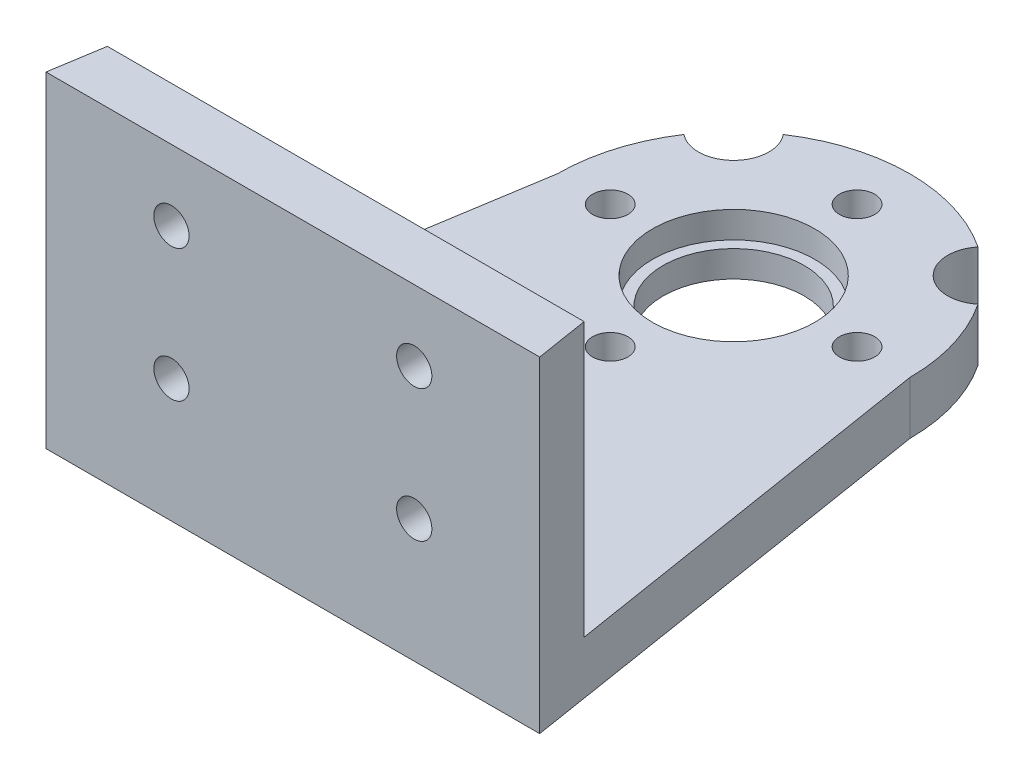
ISO-10303-21;
HEADER;
FILE_DESCRIPTION(('STEP AP214'),'2;1');
FILE_NAME('part.step','',(''),(''),'','','');
FILE_SCHEMA(('AUTOMOTIVE_DESIGN { 1 0 10303 214 1 1 1 1 }'));
ENDSEC;
DATA;
#1=APPLICATION_CONTEXT('core data for automotive mechanical design processes');
#2=APPLICATION_PROTOCOL_DEFINITION('international standard','automotive_design',2000,#1);
#3=PRODUCT_CONTEXT('',#1,'mechanical');
#4=PRODUCT('Part','Part','',(#3));
#5=PRODUCT_RELATED_PRODUCT_CATEGORY('part','',(#4));
#6=PRODUCT_DEFINITION_FORMATION('','',#4);
#7=PRODUCT_DEFINITION_CONTEXT('part definition',#1,'design');
#8=PRODUCT_DEFINITION('design','',#6,#7);
#9=PRODUCT_DEFINITION_SHAPE('','',#8);
#10=(LENGTH_UNIT() NAMED_UNIT(*) SI_UNIT(.MILLI.,.METRE.));
#11=(NAMED_UNIT(*) PLANE_ANGLE_UNIT() SI_UNIT($,.RADIAN.));
#12=(NAMED_UNIT(*) SI_UNIT($,.STERADIAN.) SOLID_ANGLE_UNIT());
#13=UNCERTAINTY_MEASURE_WITH_UNIT(LENGTH_MEASURE(1.E-05),#10,'distance_accuracy_value','');
#14=(GEOMETRIC_REPRESENTATION_CONTEXT(3) GLOBAL_UNCERTAINTY_ASSIGNED_CONTEXT((#13)) GLOBAL_UNIT_ASSIGNED_CONTEXT((#10,
#11,#12)) REPRESENTATION_CONTEXT('',''));
#15=CARTESIAN_POINT('',(0.,0.,0.));
#16=DIRECTION('',(0.,0.,1.));
#17=DIRECTION('',(1.,0.,0.));
#18=AXIS2_PLACEMENT_3D('',#15,#16,#17);
#19=CARTESIAN_POINT('',(0.,3.,0.));
#20=DIRECTION('',(0.,-1.,0.));
#21=DIRECTION('',(0.,0.,-1.));
#22=AXIS2_PLACEMENT_3D('',#19,#20,#21);
#23=CYLINDRICAL_SURFACE('',#22,10.);
#24=CARTESIAN_POINT('',(0.,0.,0.));
#25=DIRECTION('',(0.,1.,0.));
#26=DIRECTION('',(0.,0.,-1.));
#27=AXIS2_PLACEMENT_3D('',#24,#25,#26);
#28=CIRCLE('',#27,10.);
#29=CARTESIAN_POINT('',(10.,0.,0.));
#30=VERTEX_POINT('',#29);
#31=CARTESIAN_POINT('',(8.33677118357518,0.,-5.52252172768116));
#32=VERTEX_POINT('',#31);
#33=EDGE_CURVE('E220',#30,#32,#28,.T.);
#34=ORIENTED_EDGE('',*,*,#33,.T.);
#35=DIRECTION('',(0.,1.,0.));
#36=VECTOR('',#35,1.);
#37=CARTESIAN_POINT('',(8.33677118357519,-2.,-5.52252172768115));
#38=LINE('',#37,#36);
#39=CARTESIAN_POINT('',(8.33677118357519,3.,-5.52252172768115));
#40=VERTEX_POINT('',#39);
#41=EDGE_CURVE('E50',#32,#40,#38,.T.);
#42=ORIENTED_EDGE('',*,*,#41,.T.);
#43=CARTESIAN_POINT('',(0.,3.,0.));
#44=DIRECTION('',(0.,1.,0.));
#45=DIRECTION('',(0.,0.,-1.));
#46=AXIS2_PLACEMENT_3D('',#43,#44,#45);
#47=CIRCLE('',#46,10.);
#48=CARTESIAN_POINT('',(10.,3.,0.));
#49=VERTEX_POINT('',#48);
#50=EDGE_CURVE('E124',#49,#40,#47,.T.);
#51=ORIENTED_EDGE('',*,*,#50,.F.);
#52=DIRECTION('',(0.,-1.,0.));
#53=VECTOR('',#52,1.);
#54=CARTESIAN_POINT('',(10.,3.,0.));
#55=LINE('',#54,#53);
#56=EDGE_CURVE('E148',#49,#30,#55,.T.);
#57=ORIENTED_EDGE('',*,*,#56,.T.);
#58=EDGE_LOOP('',(#34,#42,#51,#57));
#59=FACE_BOUND('',#58,.T.);
#60=ADVANCED_FACE('F36',(#59),#23,.T.);
#61=CARTESIAN_POINT('',(5.52252172768112,3.,-8.33677118357521));
#62=VERTEX_POINT('',#61);
#63=CARTESIAN_POINT('',(-5.52252172768112,3.,-8.33677118357521));
#64=VERTEX_POINT('',#63);
#65=EDGE_CURVE('E121',#62,#64,#47,.T.);
#66=ORIENTED_EDGE('',*,*,#65,.F.);
#67=DIRECTION('',(0.,1.,0.));
#68=VECTOR('',#67,1.);
#69=CARTESIAN_POINT('',(5.52252172768112,-2.,-8.33677118357521));
#70=LINE('',#69,#68);
#71=CARTESIAN_POINT('',(5.52252172768113,0.,-8.3367711835752));
#72=VERTEX_POINT('',#71);
#73=EDGE_CURVE('E111',#62,#72,#70,.F.);
#74=ORIENTED_EDGE('',*,*,#73,.T.);
#75=CARTESIAN_POINT('',(-5.52252172768113,0.,-8.3367711835752));
#76=VERTEX_POINT('',#75);
#77=EDGE_CURVE('E58',#72,#76,#28,.T.);
#78=ORIENTED_EDGE('',*,*,#77,.T.);
#79=DIRECTION('',(0.,1.,0.));
#80=VECTOR('',#79,1.);
#81=CARTESIAN_POINT('',(-5.52252172768112,-2.,-8.33677118357521));
#82=LINE('',#81,#80);
#83=EDGE_CURVE('E128',#76,#64,#82,.T.);
#84=ORIENTED_EDGE('',*,*,#83,.T.);
#85=EDGE_LOOP('',(#66,#74,#78,#84));
#86=FACE_BOUND('',#85,.T.);
#87=ADVANCED_FACE('F127',(#86),#23,.T.);
#88=CARTESIAN_POINT('',(0.,-10.,0.));
#89=DIRECTION('',(0.,1.,0.));
#90=DIRECTION('',(0.,0.,1.));
#91=AXIS2_PLACEMENT_3D('',#88,#89,#90);
#92=CYLINDRICAL_SURFACE('',#91,4.);
#93=CARTESIAN_POINT('',(0.,0.,0.));
#94=DIRECTION('',(0.,-1.,0.));
#95=DIRECTION('',(0.,0.,-1.));
#96=AXIS2_PLACEMENT_3D('',#93,#94,#95);
#97=CIRCLE('',#96,4.);
#98=CARTESIAN_POINT('',(0.,0.,-4.));
#99=VERTEX_POINT('',#98);
#100=EDGE_CURVE('E216',#99,#99,#97,.T.);
#101=ORIENTED_EDGE('',*,*,#100,.T.);
#102=EDGE_LOOP('',(#101));
#103=FACE_BOUND('',#102,.T.);
#104=CARTESIAN_POINT('',(0.,1.5,0.));
#105=DIRECTION('',(0.,1.,0.));
#106=DIRECTION('',(0.,0.,1.));
#107=AXIS2_PLACEMENT_3D('',#104,#105,#106);
#108=CIRCLE('',#107,4.);
#109=CARTESIAN_POINT('',(0.,1.5,4.));
#110=VERTEX_POINT('',#109);
#111=EDGE_CURVE('E154',#110,#110,#108,.F.);
#112=ORIENTED_EDGE('',*,*,#111,.F.);
#113=EDGE_LOOP('',(#112));
#114=FACE_BOUND('',#113,.T.);
#115=ADVANCED_FACE('F351',(#103,#114),#92,.F.);
#116=CARTESIAN_POINT('',(0.,3.,0.));
#117=DIRECTION('',(0.,-1.,0.));
#118=DIRECTION('',(0.,0.,-1.));
#119=AXIS2_PLACEMENT_3D('',#116,#117,#118);
#120=PLANE('',#119);
#121=CARTESIAN_POINT('',(0.,3.,0.));
#122=DIRECTION('',(0.,1.,0.));
#123=DIRECTION('',(0.,0.,1.));
#124=AXIS2_PLACEMENT_3D('',#121,#122,#123);
#125=CIRCLE('',#124,4.6);
#126=CARTESIAN_POINT('',(0.,3.,4.6));
#127=VERTEX_POINT('',#126);
#128=EDGE_CURVE('E275',#127,#127,#125,.T.);
#129=ORIENTED_EDGE('',*,*,#128,.F.);
#130=EDGE_LOOP('',(#129));
#131=FACE_BOUND('',#130,.T.);
#132=CARTESIAN_POINT('',(-6.52,3.,19.));
#133=DIRECTION('',(0.,1.,0.));
#134=DIRECTION('',(0.,0.,1.));
#135=AXIS2_PLACEMENT_3D('',#132,#133,#134);
#136=CIRCLE('',#135,1.);
#137=CARTESIAN_POINT('',(-6.52,3.,20.));
#138=VERTEX_POINT('',#137);
#139=EDGE_CURVE('E135',#138,#138,#136,.T.);
#140=ORIENTED_EDGE('',*,*,#139,.F.);
#141=EDGE_LOOP('',(#140));
#142=FACE_BOUND('',#141,.T.);
#143=CARTESIAN_POINT('',(6.52,3.,19.));
#144=DIRECTION('',(0.,1.,0.));
#145=DIRECTION('',(0.,0.,-1.));
#146=AXIS2_PLACEMENT_3D('',#143,#144,#145);
#147=CIRCLE('',#146,1.);
#148=CARTESIAN_POINT('',(6.52,3.,18.));
#149=VERTEX_POINT('',#148);
#150=EDGE_CURVE('E189',#149,#149,#147,.T.);
#151=ORIENTED_EDGE('',*,*,#150,.F.);
#152=EDGE_LOOP('',(#151));
#153=FACE_BOUND('',#152,.T.);
#154=CARTESIAN_POINT('',(0.,3.,19.));
#155=DIRECTION('',(0.,1.,0.));
#156=DIRECTION('',(0.,0.,1.));
#157=AXIS2_PLACEMENT_3D('',#154,#155,#156);
#158=CIRCLE('',#157,1.);
#159=CARTESIAN_POINT('',(0.,3.,20.));
#160=VERTEX_POINT('',#159);
#161=EDGE_CURVE('E185',#160,#160,#158,.T.);
#162=ORIENTED_EDGE('',*,*,#161,.F.);
#163=EDGE_LOOP('',(#162));
#164=FACE_BOUND('',#163,.T.);
#165=CARTESIAN_POINT('',(0.,3.,7.));
#166=DIRECTION('',(0.,1.,0.));
#167=DIRECTION('',(0.,0.,1.));
#168=AXIS2_PLACEMENT_3D('',#165,#166,#167);
#169=CIRCLE('',#168,1.);
#170=CARTESIAN_POINT('',(0.,3.,8.));
#171=VERTEX_POINT('',#170);
#172=EDGE_CURVE('E179',#171,#171,#169,.T.);
#173=ORIENTED_EDGE('',*,*,#172,.F.);
#174=EDGE_LOOP('',(#173));
#175=FACE_BOUND('',#174,.T.);
#176=CARTESIAN_POINT('',(-7.,3.,0.));
#177=DIRECTION('',(0.,1.,0.));
#178=DIRECTION('',(0.,0.,1.));
#179=AXIS2_PLACEMENT_3D('',#176,#177,#178);
#180=CIRCLE('',#179,1.);
#181=CARTESIAN_POINT('',(-7.,3.,0.999999999999975));
#182=VERTEX_POINT('',#181);
#183=EDGE_CURVE('E173',#182,#182,#180,.T.);
#184=ORIENTED_EDGE('',*,*,#183,.F.);
#185=EDGE_LOOP('',(#184));
#186=FACE_BOUND('',#185,.T.);
#187=CARTESIAN_POINT('',(0.,3.,-7.));
#188=DIRECTION('',(0.,1.,0.));
#189=DIRECTION('',(0.,0.,1.));
#190=AXIS2_PLACEMENT_3D('',#187,#188,#189);
#191=CIRCLE('',#190,1.);
#192=CARTESIAN_POINT('',(0.,3.,-6.));
#193=VERTEX_POINT('',#192);
#194=EDGE_CURVE('E165',#193,#193,#191,.T.);
#195=ORIENTED_EDGE('',*,*,#194,.F.);
#196=EDGE_LOOP('',(#195));
#197=FACE_BOUND('',#196,.T.);
#198=CARTESIAN_POINT('',(7.,3.,0.));
#199=DIRECTION('',(0.,1.,0.));
#200=DIRECTION('',(0.,0.,1.));
#201=AXIS2_PLACEMENT_3D('',#198,#199,#200);
#202=CIRCLE('',#201,1.);
#203=CARTESIAN_POINT('',(7.,3.,1.00000000000007));
#204=VERTEX_POINT('',#203);
#205=EDGE_CURVE('E166',#204,#204,#202,.T.);
#206=ORIENTED_EDGE('',*,*,#205,.F.);
#207=EDGE_LOOP('',(#206));
#208=FACE_BOUND('',#207,.T.);
#209=ORIENTED_EDGE('',*,*,#50,.T.);
#210=CARTESIAN_POINT('',(7.07106781186546,3.,-7.07106781186549));
#211=DIRECTION('',(0.,1.,0.));
#212=DIRECTION('',(0.,0.,-1.));
#213=AXIS2_PLACEMENT_3D('',#210,#211,#212);
#214=CIRCLE('',#213,2.);
#215=EDGE_CURVE('E114',#62,#40,#214,.T.);
#216=ORIENTED_EDGE('',*,*,#215,.F.);
#217=ORIENTED_EDGE('',*,*,#65,.T.);
#218=CARTESIAN_POINT('',(-7.07106781186546,3.,-7.07106781186549));
#219=DIRECTION('',(0.,1.,0.));
#220=DIRECTION('',(0.,0.,1.));
#221=AXIS2_PLACEMENT_3D('',#218,#219,#220);
#222=CIRCLE('',#221,2.);
#223=CARTESIAN_POINT('',(-8.33677118357519,3.,-5.52252172768115));
#224=VERTEX_POINT('',#223);
#225=EDGE_CURVE('E283',#224,#64,#222,.T.);
#226=ORIENTED_EDGE('',*,*,#225,.F.);
#227=CARTESIAN_POINT('',(-10.,3.,0.));
#228=VERTEX_POINT('',#227);
#229=EDGE_CURVE('E129',#224,#228,#47,.T.);
#230=ORIENTED_EDGE('',*,*,#229,.T.);
#231=DIRECTION('',(-0.157990501106673,0.,0.987440631916705));
#232=VECTOR('',#231,1.);
#233=CARTESIAN_POINT('',(-10.,3.,0.));
#234=LINE('',#233,#232);
#235=CARTESIAN_POINT('',(-13.52,3.,22.));
#236=VERTEX_POINT('',#235);
#237=EDGE_CURVE('E131',#228,#236,#234,.T.);
#238=ORIENTED_EDGE('',*,*,#237,.T.);
#239=DIRECTION('',(-1.,0.,0.));
#240=VECTOR('',#239,1.);
#241=CARTESIAN_POINT('',(-13.52,3.,22.));
#242=LINE('',#241,#240);
#243=CARTESIAN_POINT('',(13.52,3.,22.));
#244=VERTEX_POINT('',#243);
#245=EDGE_CURVE('E149',#244,#236,#242,.T.);
#246=ORIENTED_EDGE('',*,*,#245,.F.);
#247=DIRECTION('',(-0.157990501106673,0.,-0.987440631916705));
#248=VECTOR('',#247,1.);
#249=CARTESIAN_POINT('',(10.,3.,0.));
#250=LINE('',#249,#248);
#251=EDGE_CURVE('E144',#244,#49,#250,.T.);
#252=ORIENTED_EDGE('',*,*,#251,.T.);
#253=EDGE_LOOP('',(#209,#216,#217,#226,#230,#238,#246,#252));
#254=FACE_BOUND('',#253,.T.);
#255=ADVANCED_FACE('F119',(#131,#142,#153,#164,#175,#186,#197,#208,#254),#120,.F.);
#256=ORIENTED_EDGE('',*,*,#229,.F.);
#257=DIRECTION('',(0.,1.,0.));
#258=VECTOR('',#257,1.);
#259=CARTESIAN_POINT('',(-8.33677118357519,-2.,-5.52252172768115));
#260=LINE('',#259,#258);
#261=CARTESIAN_POINT('',(-8.33677118357518,0.,-5.52252172768116));
#262=VERTEX_POINT('',#261);
#263=EDGE_CURVE('E281',#224,#262,#260,.F.);
#264=ORIENTED_EDGE('',*,*,#263,.T.);
#265=CARTESIAN_POINT('',(-10.,0.,0.));
#266=VERTEX_POINT('',#265);
#267=EDGE_CURVE('E218',#262,#266,#28,.T.);
#268=ORIENTED_EDGE('',*,*,#267,.T.);
#269=DIRECTION('',(0.,-1.,0.));
#270=VECTOR('',#269,1.);
#271=CARTESIAN_POINT('',(-10.,3.,0.));
#272=LINE('',#271,#270);
#273=EDGE_CURVE('E223',#228,#266,#272,.T.);
#274=ORIENTED_EDGE('',*,*,#273,.F.);
#275=EDGE_LOOP('',(#256,#264,#268,#274));
#276=FACE_BOUND('',#275,.T.);
#277=ADVANCED_FACE('F38',(#276),#23,.T.);
#278=CARTESIAN_POINT('',(-10.,3.,0.));
#279=DIRECTION('',(0.987440631916705,0.,0.157990501106673));
#280=DIRECTION('',(0.157990501106673,0.,-0.987440631916705));
#281=AXIS2_PLACEMENT_3D('',#278,#279,#280);
#282=PLANE('',#281);
#283=DIRECTION('',(-0.157990501106673,0.,0.987440631916705));
#284=VECTOR('',#283,1.);
#285=CARTESIAN_POINT('',(-10.,0.,0.));
#286=LINE('',#285,#284);
#287=CARTESIAN_POINT('',(-14.,0.,25.));
#288=VERTEX_POINT('',#287);
#289=EDGE_CURVE('E237',#266,#288,#286,.T.);
#290=ORIENTED_EDGE('',*,*,#289,.T.);
#291=DIRECTION('',(0.,-1.,0.));
#292=VECTOR('',#291,1.);
#293=CARTESIAN_POINT('',(-14.,3.,25.));
#294=LINE('',#293,#292);
#295=CARTESIAN_POINT('',(-14.,18.5,25.));
#296=VERTEX_POINT('',#295);
#297=EDGE_CURVE('E226',#296,#288,#294,.T.);
#298=ORIENTED_EDGE('',*,*,#297,.F.);
#299=DIRECTION('',(-0.157990501106673,0.,0.987440631916705));
#300=VECTOR('',#299,1.);
#301=CARTESIAN_POINT('',(-13.52,18.5,22.));
#302=LINE('',#301,#300);
#303=CARTESIAN_POINT('',(-13.52,18.5,22.));
#304=VERTEX_POINT('',#303);
#305=EDGE_CURVE('E153',#304,#296,#302,.T.);
#306=ORIENTED_EDGE('',*,*,#305,.F.);
#307=DIRECTION('',(0.,-1.,0.));
#308=VECTOR('',#307,1.);
#309=CARTESIAN_POINT('',(-13.52,18.5,22.));
#310=LINE('',#309,#308);
#311=EDGE_CURVE('E155',#304,#236,#310,.T.);
#312=ORIENTED_EDGE('',*,*,#311,.T.);
#313=ORIENTED_EDGE('',*,*,#237,.F.);
#314=ORIENTED_EDGE('',*,*,#273,.T.);
#315=EDGE_LOOP('',(#290,#298,#306,#312,#313,#314));
#316=FACE_BOUND('',#315,.T.);
#317=ADVANCED_FACE('F329',(#316),#282,.F.);
#318=CARTESIAN_POINT('',(-14.,3.,25.));
#319=DIRECTION('',(0.,0.,-1.));
#320=DIRECTION('',(-1.,0.,0.));
#321=AXIS2_PLACEMENT_3D('',#318,#319,#320);
#322=PLANE('',#321);
#323=CARTESIAN_POINT('',(6.88499999999998,7.,25.));
#324=DIRECTION('',(0.,0.,-1.));
#325=DIRECTION('',(-1.,0.,0.));
#326=AXIS2_PLACEMENT_3D('',#323,#324,#325);
#327=CIRCLE('',#326,1.);
#328=CARTESIAN_POINT('',(5.88499999999998,7.,25.));
#329=VERTEX_POINT('',#328);
#330=EDGE_CURVE('E291',#329,#329,#327,.T.);
#331=ORIENTED_EDGE('',*,*,#330,.T.);
#332=EDGE_LOOP('',(#331));
#333=FACE_BOUND('',#332,.T.);
#334=CARTESIAN_POINT('',(-6.88499999999999,14.5,25.));
#335=DIRECTION('',(0.,0.,-1.));
#336=DIRECTION('',(-1.,0.,0.));
#337=AXIS2_PLACEMENT_3D('',#334,#335,#336);
#338=CIRCLE('',#337,1.);
#339=CARTESIAN_POINT('',(-7.885,14.5,25.));
#340=VERTEX_POINT('',#339);
#341=EDGE_CURVE('E294',#340,#340,#338,.T.);
#342=ORIENTED_EDGE('',*,*,#341,.T.);
#343=EDGE_LOOP('',(#342));
#344=FACE_BOUND('',#343,.T.);
#345=CARTESIAN_POINT('',(6.88500000000001,14.5,25.));
#346=DIRECTION('',(0.,0.,-1.));
#347=DIRECTION('',(-1.,0.,0.));
#348=AXIS2_PLACEMENT_3D('',#345,#346,#347);
#349=CIRCLE('',#348,1.);
#350=CARTESIAN_POINT('',(5.88500000000001,14.5,25.));
#351=VERTEX_POINT('',#350);
#352=EDGE_CURVE('E297',#351,#351,#349,.T.);
#353=ORIENTED_EDGE('',*,*,#352,.T.);
#354=EDGE_LOOP('',(#353));
#355=FACE_BOUND('',#354,.T.);
#356=CARTESIAN_POINT('',(-6.88500000000002,7.,25.));
#357=DIRECTION('',(0.,0.,-1.));
#358=DIRECTION('',(-1.,0.,0.));
#359=AXIS2_PLACEMENT_3D('',#356,#357,#358);
#360=CIRCLE('',#359,1.);
#361=CARTESIAN_POINT('',(-7.88500000000002,7.,25.));
#362=VERTEX_POINT('',#361);
#363=EDGE_CURVE('E125',#362,#362,#360,.T.);
#364=ORIENTED_EDGE('',*,*,#363,.T.);
#365=EDGE_LOOP('',(#364));
#366=FACE_BOUND('',#365,.T.);
#367=DIRECTION('',(1.,0.,0.));
#368=VECTOR('',#367,1.);
#369=CARTESIAN_POINT('',(-14.,0.,25.));
#370=LINE('',#369,#368);
#371=CARTESIAN_POINT('',(14.,0.,25.));
#372=VERTEX_POINT('',#371);
#373=EDGE_CURVE('E235',#288,#372,#370,.T.);
#374=ORIENTED_EDGE('',*,*,#373,.T.);
#375=DIRECTION('',(0.,-1.,0.));
#376=VECTOR('',#375,1.);
#377=CARTESIAN_POINT('',(14.,3.,25.));
#378=LINE('',#377,#376);
#379=CARTESIAN_POINT('',(14.,18.5,25.));
#380=VERTEX_POINT('',#379);
#381=EDGE_CURVE('E229',#380,#372,#378,.T.);
#382=ORIENTED_EDGE('',*,*,#381,.F.);
#383=DIRECTION('',(1.,0.,0.));
#384=VECTOR('',#383,1.);
#385=CARTESIAN_POINT('',(-14.,18.5,25.));
#386=LINE('',#385,#384);
#387=EDGE_CURVE('E269',#296,#380,#386,.T.);
#388=ORIENTED_EDGE('',*,*,#387,.F.);
#389=ORIENTED_EDGE('',*,*,#297,.T.);
#390=EDGE_LOOP('',(#374,#382,#388,#389));
#391=FACE_BOUND('',#390,.T.);
#392=ADVANCED_FACE('F328',(#333,#344,#355,#366,#391),#322,.F.);
#393=CARTESIAN_POINT('',(10.,3.,0.));
#394=DIRECTION('',(-0.987440631916705,0.,0.157990501106673));
#395=DIRECTION('',(0.157990501106673,0.,0.987440631916705));
#396=AXIS2_PLACEMENT_3D('',#393,#394,#395);
#397=PLANE('',#396);
#398=DIRECTION('',(-0.157990501106673,0.,-0.987440631916705));
#399=VECTOR('',#398,1.);
#400=CARTESIAN_POINT('',(10.,0.,0.));
#401=LINE('',#400,#399);
#402=EDGE_CURVE('E132',#372,#30,#401,.T.);
#403=ORIENTED_EDGE('',*,*,#402,.T.);
#404=ORIENTED_EDGE('',*,*,#56,.F.);
#405=ORIENTED_EDGE('',*,*,#251,.F.);
#406=DIRECTION('',(0.,-1.,0.));
#407=VECTOR('',#406,1.);
#408=CARTESIAN_POINT('',(13.52,18.5,22.));
#409=LINE('',#408,#407);
#410=CARTESIAN_POINT('',(13.52,18.5,22.));
#411=VERTEX_POINT('',#410);
#412=EDGE_CURVE('E169',#411,#244,#409,.T.);
#413=ORIENTED_EDGE('',*,*,#412,.F.);
#414=DIRECTION('',(-0.157990501106673,0.,-0.987440631916705));
#415=VECTOR('',#414,1.);
#416=CARTESIAN_POINT('',(14.,18.5,25.));
#417=LINE('',#416,#415);
#418=EDGE_CURVE('E266',#380,#411,#417,.T.);
#419=ORIENTED_EDGE('',*,*,#418,.F.);
#420=ORIENTED_EDGE('',*,*,#381,.T.);
#421=EDGE_LOOP('',(#403,#404,#405,#413,#419,#420));
#422=FACE_BOUND('',#421,.T.);
#423=ADVANCED_FACE('F205',(#422),#397,.F.);
#424=CARTESIAN_POINT('',(0.,0.,0.));
#425=DIRECTION('',(0.,-1.,0.));
#426=DIRECTION('',(0.,0.,-1.));
#427=AXIS2_PLACEMENT_3D('',#424,#425,#426);
#428=PLANE('',#427);
#429=CARTESIAN_POINT('',(7.07106781186546,0.,-7.07106781186549));
#430=DIRECTION('',(0.,-1.,0.));
#431=DIRECTION('',(0.,0.,-1.));
#432=AXIS2_PLACEMENT_3D('',#429,#430,#431);
#433=CIRCLE('',#432,2.);
#434=EDGE_CURVE('E11',#32,#72,#433,.T.);
#435=ORIENTED_EDGE('',*,*,#434,.F.);
#436=ORIENTED_EDGE('',*,*,#33,.F.);
#437=ORIENTED_EDGE('',*,*,#402,.F.);
#438=ORIENTED_EDGE('',*,*,#373,.F.);
#439=ORIENTED_EDGE('',*,*,#289,.F.);
#440=ORIENTED_EDGE('',*,*,#267,.F.);
#441=CARTESIAN_POINT('',(-7.07106781186546,0.,-7.07106781186549));
#442=DIRECTION('',(0.,-1.,0.));
#443=DIRECTION('',(0.,0.,-1.));
#444=AXIS2_PLACEMENT_3D('',#441,#442,#443);
#445=CIRCLE('',#444,2.);
#446=EDGE_CURVE('E44',#76,#262,#445,.T.);
#447=ORIENTED_EDGE('',*,*,#446,.F.);
#448=ORIENTED_EDGE('',*,*,#77,.F.);
#449=EDGE_LOOP('',(#435,#436,#437,#438,#439,#440,#447,#448));
#450=FACE_BOUND('',#449,.T.);
#451=CARTESIAN_POINT('',(7.,0.,0.));
#452=DIRECTION('',(0.,1.,0.));
#453=DIRECTION('',(0.,0.,1.));
#454=AXIS2_PLACEMENT_3D('',#451,#452,#453);
#455=CIRCLE('',#454,1.);
#456=CARTESIAN_POINT('',(7.,0.,1.00000000000007));
#457=VERTEX_POINT('',#456);
#458=EDGE_CURVE('E162',#457,#457,#455,.T.);
#459=ORIENTED_EDGE('',*,*,#458,.T.);
#460=EDGE_LOOP('',(#459));
#461=FACE_BOUND('',#460,.T.);
#462=CARTESIAN_POINT('',(0.,0.,-7.));
#463=DIRECTION('',(0.,1.,0.));
#464=DIRECTION('',(0.,0.,1.));
#465=AXIS2_PLACEMENT_3D('',#462,#463,#464);
#466=CIRCLE('',#465,1.);
#467=CARTESIAN_POINT('',(0.,0.,-6.));
#468=VERTEX_POINT('',#467);
#469=EDGE_CURVE('E170',#468,#468,#466,.T.);
#470=ORIENTED_EDGE('',*,*,#469,.T.);
#471=EDGE_LOOP('',(#470));
#472=FACE_BOUND('',#471,.T.);
#473=CARTESIAN_POINT('',(-7.,0.,0.));
#474=DIRECTION('',(0.,1.,0.));
#475=DIRECTION('',(0.,0.,1.));
#476=AXIS2_PLACEMENT_3D('',#473,#474,#475);
#477=CIRCLE('',#476,1.);
#478=CARTESIAN_POINT('',(-7.,0.,0.999999999999975));
#479=VERTEX_POINT('',#478);
#480=EDGE_CURVE('E176',#479,#479,#477,.T.);
#481=ORIENTED_EDGE('',*,*,#480,.T.);
#482=EDGE_LOOP('',(#481));
#483=FACE_BOUND('',#482,.T.);
#484=CARTESIAN_POINT('',(0.,0.,7.));
#485=DIRECTION('',(0.,1.,0.));
#486=DIRECTION('',(0.,0.,1.));
#487=AXIS2_PLACEMENT_3D('',#484,#485,#486);
#488=CIRCLE('',#487,1.);
#489=CARTESIAN_POINT('',(0.,0.,8.));
#490=VERTEX_POINT('',#489);
#491=EDGE_CURVE('E182',#490,#490,#488,.T.);
#492=ORIENTED_EDGE('',*,*,#491,.T.);
#493=EDGE_LOOP('',(#492));
#494=FACE_BOUND('',#493,.T.);
#495=CARTESIAN_POINT('',(0.,0.,19.));
#496=DIRECTION('',(0.,-1.,0.));
#497=DIRECTION('',(0.,0.,-1.));
#498=AXIS2_PLACEMENT_3D('',#495,#496,#497);
#499=CIRCLE('',#498,1.);
#500=CARTESIAN_POINT('',(0.,0.,18.));
#501=VERTEX_POINT('',#500);
#502=EDGE_CURVE('E145',#501,#501,#499,.T.);
#503=ORIENTED_EDGE('',*,*,#502,.F.);
#504=EDGE_LOOP('',(#503));
#505=FACE_BOUND('',#504,.T.);
#506=CARTESIAN_POINT('',(6.52,0.,19.));
#507=DIRECTION('',(0.,-1.,0.));
#508=DIRECTION('',(0.,0.,-1.));
#509=AXIS2_PLACEMENT_3D('',#506,#507,#508);
#510=CIRCLE('',#509,1.);
#511=CARTESIAN_POINT('',(6.52,0.,18.));
#512=VERTEX_POINT('',#511);
#513=EDGE_CURVE('E191',#512,#512,#510,.T.);
#514=ORIENTED_EDGE('',*,*,#513,.F.);
#515=EDGE_LOOP('',(#514));
#516=FACE_BOUND('',#515,.T.);
#517=CARTESIAN_POINT('',(-6.52,0.,19.));
#518=DIRECTION('',(0.,-1.,0.));
#519=DIRECTION('',(0.,0.,-1.));
#520=AXIS2_PLACEMENT_3D('',#517,#518,#519);
#521=CIRCLE('',#520,1.);
#522=CARTESIAN_POINT('',(-6.52,0.,18.));
#523=VERTEX_POINT('',#522);
#524=EDGE_CURVE('E213',#523,#523,#521,.T.);
#525=ORIENTED_EDGE('',*,*,#524,.F.);
#526=EDGE_LOOP('',(#525));
#527=FACE_BOUND('',#526,.T.);
#528=ORIENTED_EDGE('',*,*,#100,.F.);
#529=EDGE_LOOP('',(#528));
#530=FACE_BOUND('',#529,.T.);
#531=ADVANCED_FACE('F201',(#450,#461,#472,#483,#494,#505,#516,#527,#530),#428,.T.);
#532=CARTESIAN_POINT('',(-6.52,-10.,19.));
#533=DIRECTION('',(0.,1.,0.));
#534=DIRECTION('',(0.,0.,1.));
#535=AXIS2_PLACEMENT_3D('',#532,#533,#534);
#536=CYLINDRICAL_SURFACE('',#535,1.);
#537=ORIENTED_EDGE('',*,*,#524,.T.);
#538=EDGE_LOOP('',(#537));
#539=FACE_BOUND('',#538,.T.);
#540=ORIENTED_EDGE('',*,*,#139,.T.);
#541=EDGE_LOOP('',(#540));
#542=FACE_BOUND('',#541,.T.);
#543=ADVANCED_FACE('F204',(#539,#542),#536,.F.);
#544=CARTESIAN_POINT('',(6.52,-10.,19.));
#545=DIRECTION('',(0.,1.,0.));
#546=DIRECTION('',(0.,0.,1.));
#547=AXIS2_PLACEMENT_3D('',#544,#545,#546);
#548=CYLINDRICAL_SURFACE('',#547,1.);
#549=ORIENTED_EDGE('',*,*,#513,.T.);
#550=EDGE_LOOP('',(#549));
#551=FACE_BOUND('',#550,.T.);
#552=ORIENTED_EDGE('',*,*,#150,.T.);
#553=EDGE_LOOP('',(#552));
#554=FACE_BOUND('',#553,.T.);
#555=ADVANCED_FACE('F547',(#551,#554),#548,.F.);
#556=CARTESIAN_POINT('',(0.,-10.,19.));
#557=DIRECTION('',(0.,1.,0.));
#558=DIRECTION('',(0.,0.,1.));
#559=AXIS2_PLACEMENT_3D('',#556,#557,#558);
#560=CYLINDRICAL_SURFACE('',#559,1.);
#561=ORIENTED_EDGE('',*,*,#502,.T.);
#562=EDGE_LOOP('',(#561));
#563=FACE_BOUND('',#562,.T.);
#564=ORIENTED_EDGE('',*,*,#161,.T.);
#565=EDGE_LOOP('',(#564));
#566=FACE_BOUND('',#565,.T.);
#567=ADVANCED_FACE('F198',(#563,#566),#560,.F.);
#568=CARTESIAN_POINT('',(0.,0.,7.));
#569=DIRECTION('',(0.,1.,0.));
#570=DIRECTION('',(0.,0.,1.));
#571=AXIS2_PLACEMENT_3D('',#568,#569,#570);
#572=CYLINDRICAL_SURFACE('',#571,1.);
#573=ORIENTED_EDGE('',*,*,#491,.F.);
#574=EDGE_LOOP('',(#573));
#575=FACE_BOUND('',#574,.T.);
#576=ORIENTED_EDGE('',*,*,#172,.T.);
#577=EDGE_LOOP('',(#576));
#578=FACE_BOUND('',#577,.T.);
#579=ADVANCED_FACE('F528',(#575,#578),#572,.F.);
#580=CARTESIAN_POINT('',(-7.,0.,0.));
#581=DIRECTION('',(0.,1.,0.));
#582=DIRECTION('',(0.,0.,1.));
#583=AXIS2_PLACEMENT_3D('',#580,#581,#582);
#584=CYLINDRICAL_SURFACE('',#583,1.);
#585=ORIENTED_EDGE('',*,*,#480,.F.);
#586=EDGE_LOOP('',(#585));
#587=FACE_BOUND('',#586,.T.);
#588=ORIENTED_EDGE('',*,*,#183,.T.);
#589=EDGE_LOOP('',(#588));
#590=FACE_BOUND('',#589,.T.);
#591=ADVANCED_FACE('F518',(#587,#590),#584,.F.);
#592=CARTESIAN_POINT('',(0.,0.,-7.));
#593=DIRECTION('',(0.,1.,0.));
#594=DIRECTION('',(0.,0.,1.));
#595=AXIS2_PLACEMENT_3D('',#592,#593,#594);
#596=CYLINDRICAL_SURFACE('',#595,1.);
#597=ORIENTED_EDGE('',*,*,#469,.F.);
#598=EDGE_LOOP('',(#597));
#599=FACE_BOUND('',#598,.T.);
#600=ORIENTED_EDGE('',*,*,#194,.T.);
#601=EDGE_LOOP('',(#600));
#602=FACE_BOUND('',#601,.T.);
#603=ADVANCED_FACE('F508',(#599,#602),#596,.F.);
#604=CARTESIAN_POINT('',(7.,0.,0.));
#605=DIRECTION('',(0.,1.,0.));
#606=DIRECTION('',(0.,0.,1.));
#607=AXIS2_PLACEMENT_3D('',#604,#605,#606);
#608=CYLINDRICAL_SURFACE('',#607,1.);
#609=ORIENTED_EDGE('',*,*,#458,.F.);
#610=EDGE_LOOP('',(#609));
#611=FACE_BOUND('',#610,.T.);
#612=ORIENTED_EDGE('',*,*,#205,.T.);
#613=EDGE_LOOP('',(#612));
#614=FACE_BOUND('',#613,.T.);
#615=ADVANCED_FACE('F317',(#611,#614),#608,.F.);
#616=CARTESIAN_POINT('',(-13.52,18.5,22.));
#617=DIRECTION('',(0.,0.,1.));
#618=DIRECTION('',(1.,0.,0.));
#619=AXIS2_PLACEMENT_3D('',#616,#617,#618);
#620=PLANE('',#619);
#621=CARTESIAN_POINT('',(6.88499999999998,7.,22.));
#622=DIRECTION('',(0.,0.,-1.));
#623=DIRECTION('',(-1.,0.,0.));
#624=AXIS2_PLACEMENT_3D('',#621,#622,#623);
#625=CIRCLE('',#624,1.);
#626=CARTESIAN_POINT('',(5.88499999999998,7.,22.));
#627=VERTEX_POINT('',#626);
#628=EDGE_CURVE('E300',#627,#627,#625,.T.);
#629=ORIENTED_EDGE('',*,*,#628,.F.);
#630=EDGE_LOOP('',(#629));
#631=FACE_BOUND('',#630,.T.);
#632=CARTESIAN_POINT('',(-6.88499999999999,14.5,22.));
#633=DIRECTION('',(0.,0.,-1.));
#634=DIRECTION('',(-1.,0.,0.));
#635=AXIS2_PLACEMENT_3D('',#632,#633,#634);
#636=CIRCLE('',#635,1.);
#637=CARTESIAN_POINT('',(-7.885,14.5,22.));
#638=VERTEX_POINT('',#637);
#639=EDGE_CURVE('E304',#638,#638,#636,.T.);
#640=ORIENTED_EDGE('',*,*,#639,.F.);
#641=EDGE_LOOP('',(#640));
#642=FACE_BOUND('',#641,.T.);
#643=CARTESIAN_POINT('',(6.88500000000001,14.5,22.));
#644=DIRECTION('',(0.,0.,-1.));
#645=DIRECTION('',(-1.,0.,0.));
#646=AXIS2_PLACEMENT_3D('',#643,#644,#645);
#647=CIRCLE('',#646,1.);
#648=CARTESIAN_POINT('',(5.88500000000001,14.5,22.));
#649=VERTEX_POINT('',#648);
#650=EDGE_CURVE('E301',#649,#649,#647,.T.);
#651=ORIENTED_EDGE('',*,*,#650,.F.);
#652=EDGE_LOOP('',(#651));
#653=FACE_BOUND('',#652,.T.);
#654=CARTESIAN_POINT('',(-6.88500000000002,7.,22.));
#655=DIRECTION('',(0.,0.,-1.));
#656=DIRECTION('',(-1.,0.,0.));
#657=AXIS2_PLACEMENT_3D('',#654,#655,#656);
#658=CIRCLE('',#657,1.);
#659=CARTESIAN_POINT('',(-7.88500000000002,7.,22.));
#660=VERTEX_POINT('',#659);
#661=EDGE_CURVE('E288',#660,#660,#658,.T.);
#662=ORIENTED_EDGE('',*,*,#661,.F.);
#663=EDGE_LOOP('',(#662));
#664=FACE_BOUND('',#663,.T.);
#665=ORIENTED_EDGE('',*,*,#245,.T.);
#666=ORIENTED_EDGE('',*,*,#311,.F.);
#667=DIRECTION('',(-1.,0.,0.));
#668=VECTOR('',#667,1.);
#669=CARTESIAN_POINT('',(-13.52,18.5,22.));
#670=LINE('',#669,#668);
#671=EDGE_CURVE('E160',#411,#304,#670,.T.);
#672=ORIENTED_EDGE('',*,*,#671,.F.);
#673=ORIENTED_EDGE('',*,*,#412,.T.);
#674=EDGE_LOOP('',(#665,#666,#672,#673));
#675=FACE_BOUND('',#674,.T.);
#676=ADVANCED_FACE('F313',(#631,#642,#653,#664,#675),#620,.F.);
#677=CARTESIAN_POINT('',(0.,18.5,0.));
#678=DIRECTION('',(0.,1.,0.));
#679=DIRECTION('',(0.,0.,1.));
#680=AXIS2_PLACEMENT_3D('',#677,#678,#679);
#681=PLANE('',#680);
#682=ORIENTED_EDGE('',*,*,#305,.T.);
#683=ORIENTED_EDGE('',*,*,#387,.T.);
#684=ORIENTED_EDGE('',*,*,#418,.T.);
#685=ORIENTED_EDGE('',*,*,#671,.T.);
#686=EDGE_LOOP('',(#682,#683,#684,#685));
#687=FACE_BOUND('',#686,.T.);
#688=ADVANCED_FACE('F316',(#687),#681,.T.);
#689=CARTESIAN_POINT('',(0.,1.5,0.));
#690=DIRECTION('',(0.,1.,0.));
#691=DIRECTION('',(0.,0.,1.));
#692=AXIS2_PLACEMENT_3D('',#689,#690,#691);
#693=PLANE('',#692);
#694=CARTESIAN_POINT('',(0.,1.5,0.));
#695=DIRECTION('',(0.,1.,0.));
#696=DIRECTION('',(0.,0.,1.));
#697=AXIS2_PLACEMENT_3D('',#694,#695,#696);
#698=CIRCLE('',#697,4.6);
#699=CARTESIAN_POINT('',(0.,1.5,4.6));
#700=VERTEX_POINT('',#699);
#701=EDGE_CURVE('E253',#700,#700,#698,.T.);
#702=ORIENTED_EDGE('',*,*,#701,.T.);
#703=EDGE_LOOP('',(#702));
#704=FACE_BOUND('',#703,.T.);
#705=ORIENTED_EDGE('',*,*,#111,.T.);
#706=EDGE_LOOP('',(#705));
#707=FACE_BOUND('',#706,.T.);
#708=ADVANCED_FACE('F343',(#704,#707),#693,.T.);
#709=CARTESIAN_POINT('',(0.,1.5,0.));
#710=DIRECTION('',(0.,1.,0.));
#711=DIRECTION('',(0.,0.,1.));
#712=AXIS2_PLACEMENT_3D('',#709,#710,#711);
#713=CYLINDRICAL_SURFACE('',#712,4.6);
#714=ORIENTED_EDGE('',*,*,#701,.F.);
#715=EDGE_LOOP('',(#714));
#716=FACE_BOUND('',#715,.T.);
#717=ORIENTED_EDGE('',*,*,#128,.T.);
#718=EDGE_LOOP('',(#717));
#719=FACE_BOUND('',#718,.T.);
#720=ADVANCED_FACE('F335',(#716,#719),#713,.F.);
#721=CARTESIAN_POINT('',(-7.07106781186546,-7.,-7.07106781186549));
#722=DIRECTION('',(0.,1.,0.));
#723=DIRECTION('',(0.,0.,1.));
#724=AXIS2_PLACEMENT_3D('',#721,#722,#723);
#725=CYLINDRICAL_SURFACE('',#724,2.);
#726=ORIENTED_EDGE('',*,*,#446,.T.);
#727=ORIENTED_EDGE('',*,*,#263,.F.);
#728=ORIENTED_EDGE('',*,*,#225,.T.);
#729=ORIENTED_EDGE('',*,*,#83,.F.);
#730=EDGE_LOOP('',(#726,#727,#728,#729));
#731=FACE_BOUND('',#730,.T.);
#732=ADVANCED_FACE('F333',(#731),#725,.F.);
#733=CARTESIAN_POINT('',(7.07106781186546,-7.,-7.07106781186549));
#734=DIRECTION('',(0.,1.,0.));
#735=DIRECTION('',(0.,0.,1.));
#736=AXIS2_PLACEMENT_3D('',#733,#734,#735);
#737=CYLINDRICAL_SURFACE('',#736,2.);
#738=ORIENTED_EDGE('',*,*,#434,.T.);
#739=ORIENTED_EDGE('',*,*,#73,.F.);
#740=ORIENTED_EDGE('',*,*,#215,.T.);
#741=ORIENTED_EDGE('',*,*,#41,.F.);
#742=EDGE_LOOP('',(#738,#739,#740,#741));
#743=FACE_BOUND('',#742,.T.);
#744=ADVANCED_FACE('F113',(#743),#737,.F.);
#745=CARTESIAN_POINT('',(-6.88500000000002,7.,32.));
#746=DIRECTION('',(0.,0.,-1.));
#747=DIRECTION('',(-1.,0.,0.));
#748=AXIS2_PLACEMENT_3D('',#745,#746,#747);
#749=CYLINDRICAL_SURFACE('',#748,1.);
#750=ORIENTED_EDGE('',*,*,#661,.T.);
#751=EDGE_LOOP('',(#750));
#752=FACE_BOUND('',#751,.T.);
#753=ORIENTED_EDGE('',*,*,#363,.F.);
#754=EDGE_LOOP('',(#753));
#755=FACE_BOUND('',#754,.T.);
#756=ADVANCED_FACE('F341',(#752,#755),#749,.F.);
#757=CARTESIAN_POINT('',(6.88500000000001,14.5,32.));
#758=DIRECTION('',(0.,0.,-1.));
#759=DIRECTION('',(-1.,0.,0.));
#760=AXIS2_PLACEMENT_3D('',#757,#758,#759);
#761=CYLINDRICAL_SURFACE('',#760,1.);
#762=ORIENTED_EDGE('',*,*,#650,.T.);
#763=EDGE_LOOP('',(#762));
#764=FACE_BOUND('',#763,.T.);
#765=ORIENTED_EDGE('',*,*,#352,.F.);
#766=EDGE_LOOP('',(#765));
#767=FACE_BOUND('',#766,.T.);
#768=ADVANCED_FACE('F382',(#764,#767),#761,.F.);
#769=CARTESIAN_POINT('',(-6.88499999999999,14.5,32.));
#770=DIRECTION('',(0.,0.,-1.));
#771=DIRECTION('',(-1.,0.,0.));
#772=AXIS2_PLACEMENT_3D('',#769,#770,#771);
#773=CYLINDRICAL_SURFACE('',#772,1.);
#774=ORIENTED_EDGE('',*,*,#639,.T.);
#775=EDGE_LOOP('',(#774));
#776=FACE_BOUND('',#775,.T.);
#777=ORIENTED_EDGE('',*,*,#341,.F.);
#778=EDGE_LOOP('',(#777));
#779=FACE_BOUND('',#778,.T.);
#780=ADVANCED_FACE('F388',(#776,#779),#773,.F.);
#781=CARTESIAN_POINT('',(6.88499999999998,7.,32.));
#782=DIRECTION('',(0.,0.,-1.));
#783=DIRECTION('',(-1.,0.,0.));
#784=AXIS2_PLACEMENT_3D('',#781,#782,#783);
#785=CYLINDRICAL_SURFACE('',#784,1.);
#786=ORIENTED_EDGE('',*,*,#628,.T.);
#787=EDGE_LOOP('',(#786));
#788=FACE_BOUND('',#787,.T.);
#789=ORIENTED_EDGE('',*,*,#330,.F.);
#790=EDGE_LOOP('',(#789));
#791=FACE_BOUND('',#790,.T.);
#792=ADVANCED_FACE('F310',(#788,#791),#785,.F.);
#793=CLOSED_SHELL('',(#60,#87,#115,#255,#277,#317,#392,#423,#531,#543,#555,#567,#579,#591,#603,
#615,#676,#688,#708,#720,#732,#744,#756,#768,#780,#792));
#794=MANIFOLD_SOLID_BREP('B2',#793);
#795=ADVANCED_BREP_SHAPE_REPRESENTATION('',(#18,#794),#14);
#796=SHAPE_DEFINITION_REPRESENTATION(#9,#795);
ENDSEC;
END-ISO-10303-21;
